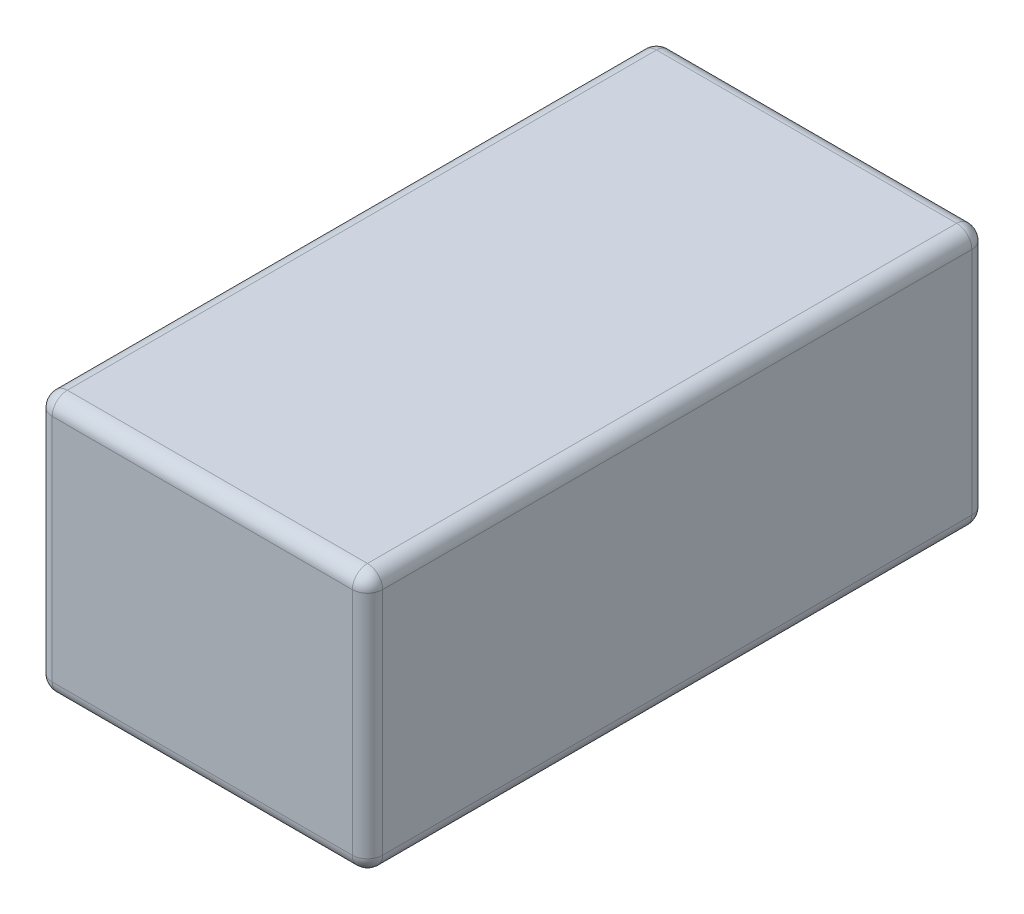
ISO-10303-21;
HEADER;
FILE_DESCRIPTION(('STEP AP214'),'2;1');
FILE_NAME('part.step','',(''),(''),'','','');
FILE_SCHEMA(('AUTOMOTIVE_DESIGN { 1 0 10303 214 1 1 1 1 }'));
ENDSEC;
DATA;
#1=APPLICATION_CONTEXT('core data for automotive mechanical design processes');
#2=APPLICATION_PROTOCOL_DEFINITION('international standard','automotive_design',2000,#1);
#3=PRODUCT_CONTEXT('',#1,'mechanical');
#4=PRODUCT('Part','Part','',(#3));
#5=PRODUCT_RELATED_PRODUCT_CATEGORY('part','',(#4));
#6=PRODUCT_DEFINITION_FORMATION('','',#4);
#7=PRODUCT_DEFINITION_CONTEXT('part definition',#1,'design');
#8=PRODUCT_DEFINITION('design','',#6,#7);
#9=PRODUCT_DEFINITION_SHAPE('','',#8);
#10=(LENGTH_UNIT() NAMED_UNIT(*) SI_UNIT(.MILLI.,.METRE.));
#11=(NAMED_UNIT(*) PLANE_ANGLE_UNIT() SI_UNIT($,.RADIAN.));
#12=(NAMED_UNIT(*) SI_UNIT($,.STERADIAN.) SOLID_ANGLE_UNIT());
#13=UNCERTAINTY_MEASURE_WITH_UNIT(LENGTH_MEASURE(1.E-05),#10,'distance_accuracy_value','');
#14=(GEOMETRIC_REPRESENTATION_CONTEXT(3) GLOBAL_UNCERTAINTY_ASSIGNED_CONTEXT((#13)) GLOBAL_UNIT_ASSIGNED_CONTEXT((#10,
#11,#12)) REPRESENTATION_CONTEXT('',''));
#15=CARTESIAN_POINT('',(0.,0.,0.));
#16=DIRECTION('',(0.,0.,1.));
#17=DIRECTION('',(1.,0.,0.));
#18=AXIS2_PLACEMENT_3D('',#15,#16,#17);
#19=CARTESIAN_POINT('',(41.5925,65.532,77.978));
#20=DIRECTION('',(-1.,0.,0.));
#21=DIRECTION('',(0.,0.,1.));
#22=AXIS2_PLACEMENT_3D('',#19,#20,#21);
#23=PLANE('',#22);
#24=DIRECTION('',(0.,-1.,0.));
#25=VECTOR('',#24,1.);
#26=CARTESIAN_POINT('',(41.5925,65.532,74.168));
#27=LINE('',#26,#25);
#28=CARTESIAN_POINT('',(41.5925,61.722,74.168));
#29=VERTEX_POINT('',#28);
#30=CARTESIAN_POINT('',(41.5925,3.81,74.168));
#31=VERTEX_POINT('',#30);
#32=EDGE_CURVE('E330',#29,#31,#27,.T.);
#33=ORIENTED_EDGE('',*,*,#32,.T.);
#34=DIRECTION('',(0.,0.,-1.));
#35=VECTOR('',#34,1.);
#36=CARTESIAN_POINT('',(41.5925,3.81,-77.978));
#37=LINE('',#36,#35);
#38=CARTESIAN_POINT('',(41.5925,3.81,-74.168));
#39=VERTEX_POINT('',#38);
#40=EDGE_CURVE('E335',#31,#39,#37,.T.);
#41=ORIENTED_EDGE('',*,*,#40,.T.);
#42=DIRECTION('',(0.,-1.,0.));
#43=VECTOR('',#42,1.);
#44=CARTESIAN_POINT('',(41.5925,65.532,-74.168));
#45=LINE('',#44,#43);
#46=CARTESIAN_POINT('',(41.5925,61.722,-74.168));
#47=VERTEX_POINT('',#46);
#48=EDGE_CURVE('E243',#39,#47,#45,.F.);
#49=ORIENTED_EDGE('',*,*,#48,.T.);
#50=DIRECTION('',(0.,0.,-1.));
#51=VECTOR('',#50,1.);
#52=CARTESIAN_POINT('',(41.5925,61.722,77.978));
#53=LINE('',#52,#51);
#54=EDGE_CURVE('E310',#47,#29,#53,.F.);
#55=ORIENTED_EDGE('',*,*,#54,.T.);
#56=EDGE_LOOP('',(#33,#41,#49,#55));
#57=FACE_BOUND('',#56,.T.);
#58=ADVANCED_FACE('F40',(#57),#23,.F.);
#59=CARTESIAN_POINT('',(-41.5925,65.532,-77.978));
#60=DIRECTION('',(0.,0.,1.));
#61=DIRECTION('',(1.,0.,0.));
#62=AXIS2_PLACEMENT_3D('',#59,#60,#61);
#63=PLANE('',#62);
#64=DIRECTION('',(-1.,0.,0.));
#65=VECTOR('',#64,1.);
#66=CARTESIAN_POINT('',(-41.5925,61.722,-77.978));
#67=LINE('',#66,#65);
#68=CARTESIAN_POINT('',(-37.7825,61.722,-77.978));
#69=VERTEX_POINT('',#68);
#70=CARTESIAN_POINT('',(37.7825,61.722,-77.978));
#71=VERTEX_POINT('',#70);
#72=EDGE_CURVE('E250',#69,#71,#67,.F.);
#73=ORIENTED_EDGE('',*,*,#72,.T.);
#74=DIRECTION('',(0.,-1.,0.));
#75=VECTOR('',#74,1.);
#76=CARTESIAN_POINT('',(37.7825,65.532,-77.978));
#77=LINE('',#76,#75);
#78=CARTESIAN_POINT('',(37.7825,3.81,-77.978));
#79=VERTEX_POINT('',#78);
#80=EDGE_CURVE('E246',#71,#79,#77,.T.);
#81=ORIENTED_EDGE('',*,*,#80,.T.);
#82=DIRECTION('',(-1.,0.,0.));
#83=VECTOR('',#82,1.);
#84=CARTESIAN_POINT('',(-41.5925,3.81,-77.978));
#85=LINE('',#84,#83);
#86=CARTESIAN_POINT('',(-37.7825,3.81,-77.978));
#87=VERTEX_POINT('',#86);
#88=EDGE_CURVE('E338',#79,#87,#85,.T.);
#89=ORIENTED_EDGE('',*,*,#88,.T.);
#90=DIRECTION('',(0.,-1.,0.));
#91=VECTOR('',#90,1.);
#92=CARTESIAN_POINT('',(-37.7825,65.532,-77.978));
#93=LINE('',#92,#91);
#94=EDGE_CURVE('E257',#87,#69,#93,.F.);
#95=ORIENTED_EDGE('',*,*,#94,.T.);
#96=EDGE_LOOP('',(#73,#81,#89,#95));
#97=FACE_BOUND('',#96,.T.);
#98=ADVANCED_FACE('F344',(#97),#63,.F.);
#99=CARTESIAN_POINT('',(-41.5925,65.532,77.978));
#100=DIRECTION('',(1.,0.,0.));
#101=DIRECTION('',(0.,0.,-1.));
#102=AXIS2_PLACEMENT_3D('',#99,#100,#101);
#103=PLANE('',#102);
#104=DIRECTION('',(0.,-1.,0.));
#105=VECTOR('',#104,1.);
#106=CARTESIAN_POINT('',(-41.5925,65.532,-74.168));
#107=LINE('',#106,#105);
#108=CARTESIAN_POINT('',(-41.5925,61.722,-74.168));
#109=VERTEX_POINT('',#108);
#110=CARTESIAN_POINT('',(-41.5925,3.81,-74.168));
#111=VERTEX_POINT('',#110);
#112=EDGE_CURVE('E141',#109,#111,#107,.T.);
#113=ORIENTED_EDGE('',*,*,#112,.T.);
#114=DIRECTION('',(0.,0.,1.));
#115=VECTOR('',#114,1.);
#116=CARTESIAN_POINT('',(-41.5925,3.81,77.978));
#117=LINE('',#116,#115);
#118=CARTESIAN_POINT('',(-41.5925,3.81,74.168));
#119=VERTEX_POINT('',#118);
#120=EDGE_CURVE('E136',#111,#119,#117,.T.);
#121=ORIENTED_EDGE('',*,*,#120,.T.);
#122=DIRECTION('',(0.,-1.,0.));
#123=VECTOR('',#122,1.);
#124=CARTESIAN_POINT('',(-41.5925,65.532,74.168));
#125=LINE('',#124,#123);
#126=CARTESIAN_POINT('',(-41.5925,61.722,74.168));
#127=VERTEX_POINT('',#126);
#128=EDGE_CURVE('E130',#119,#127,#125,.F.);
#129=ORIENTED_EDGE('',*,*,#128,.T.);
#130=DIRECTION('',(0.,0.,1.));
#131=VECTOR('',#130,1.);
#132=CARTESIAN_POINT('',(-41.5925,61.722,77.978));
#133=LINE('',#132,#131);
#134=EDGE_CURVE('E133',#127,#109,#133,.F.);
#135=ORIENTED_EDGE('',*,*,#134,.T.);
#136=EDGE_LOOP('',(#113,#121,#129,#135));
#137=FACE_BOUND('',#136,.T.);
#138=ADVANCED_FACE('F132',(#137),#103,.F.);
#139=CARTESIAN_POINT('',(-41.5925,65.532,77.978));
#140=DIRECTION('',(0.,0.,-1.));
#141=DIRECTION('',(-1.,0.,0.));
#142=AXIS2_PLACEMENT_3D('',#139,#140,#141);
#143=PLANE('',#142);
#144=DIRECTION('',(1.,0.,0.));
#145=VECTOR('',#144,1.);
#146=CARTESIAN_POINT('',(-41.5925,61.722,77.978));
#147=LINE('',#146,#145);
#148=CARTESIAN_POINT('',(37.7825,61.722,77.978));
#149=VERTEX_POINT('',#148);
#150=CARTESIAN_POINT('',(-37.7825,61.722,77.978));
#151=VERTEX_POINT('',#150);
#152=EDGE_CURVE('E50',#149,#151,#147,.F.);
#153=ORIENTED_EDGE('',*,*,#152,.T.);
#154=DIRECTION('',(0.,-1.,0.));
#155=VECTOR('',#154,1.);
#156=CARTESIAN_POINT('',(-37.7825,65.532,77.978));
#157=LINE('',#156,#155);
#158=CARTESIAN_POINT('',(-37.7825,3.81,77.978));
#159=VERTEX_POINT('',#158);
#160=EDGE_CURVE('E11',#151,#159,#157,.T.);
#161=ORIENTED_EDGE('',*,*,#160,.T.);
#162=DIRECTION('',(1.,0.,0.));
#163=VECTOR('',#162,1.);
#164=CARTESIAN_POINT('',(41.5925,3.81,77.978));
#165=LINE('',#164,#163);
#166=CARTESIAN_POINT('',(37.7825,3.81,77.978));
#167=VERTEX_POINT('',#166);
#168=EDGE_CURVE('E270',#159,#167,#165,.T.);
#169=ORIENTED_EDGE('',*,*,#168,.T.);
#170=DIRECTION('',(0.,-1.,0.));
#171=VECTOR('',#170,1.);
#172=CARTESIAN_POINT('',(37.7825,65.532,77.978));
#173=LINE('',#172,#171);
#174=EDGE_CURVE('E61',#167,#149,#173,.F.);
#175=ORIENTED_EDGE('',*,*,#174,.T.);
#176=EDGE_LOOP('',(#153,#161,#169,#175));
#177=FACE_BOUND('',#176,.T.);
#178=ADVANCED_FACE('F448',(#177),#143,.F.);
#179=CARTESIAN_POINT('',(0.,65.532,0.));
#180=DIRECTION('',(0.,-1.,0.));
#181=DIRECTION('',(0.,0.,-1.));
#182=AXIS2_PLACEMENT_3D('',#179,#180,#181);
#183=PLANE('',#182);
#184=DIRECTION('',(1.,0.,0.));
#185=VECTOR('',#184,1.);
#186=CARTESIAN_POINT('',(0.,65.532,74.168));
#187=LINE('',#186,#185);
#188=CARTESIAN_POINT('',(-37.7825,65.532,74.168));
#189=VERTEX_POINT('',#188);
#190=CARTESIAN_POINT('',(37.7825,65.532,74.168));
#191=VERTEX_POINT('',#190);
#192=EDGE_CURVE('E255',#189,#191,#187,.T.);
#193=ORIENTED_EDGE('',*,*,#192,.T.);
#194=DIRECTION('',(0.,0.,-1.));
#195=VECTOR('',#194,1.);
#196=CARTESIAN_POINT('',(37.7825,65.532,0.));
#197=LINE('',#196,#195);
#198=CARTESIAN_POINT('',(37.7825,65.532,-74.168));
#199=VERTEX_POINT('',#198);
#200=EDGE_CURVE('E267',#191,#199,#197,.T.);
#201=ORIENTED_EDGE('',*,*,#200,.T.);
#202=DIRECTION('',(-1.,0.,0.));
#203=VECTOR('',#202,1.);
#204=CARTESIAN_POINT('',(0.,65.532,-74.168));
#205=LINE('',#204,#203);
#206=CARTESIAN_POINT('',(-37.7825,65.532,-74.168));
#207=VERTEX_POINT('',#206);
#208=EDGE_CURVE('E263',#199,#207,#205,.T.);
#209=ORIENTED_EDGE('',*,*,#208,.T.);
#210=DIRECTION('',(0.,0.,1.));
#211=VECTOR('',#210,1.);
#212=CARTESIAN_POINT('',(-37.7825,65.532,0.));
#213=LINE('',#212,#211);
#214=EDGE_CURVE('E249',#207,#189,#213,.T.);
#215=ORIENTED_EDGE('',*,*,#214,.T.);
#216=EDGE_LOOP('',(#193,#201,#209,#215));
#217=FACE_BOUND('',#216,.T.);
#218=ADVANCED_FACE('F409',(#217),#183,.F.);
#219=CARTESIAN_POINT('',(0.,0.,0.));
#220=DIRECTION('',(0.,-1.,0.));
#221=DIRECTION('',(0.,0.,-1.));
#222=AXIS2_PLACEMENT_3D('',#219,#220,#221);
#223=PLANE('',#222);
#224=DIRECTION('',(0.,0.,1.));
#225=VECTOR('',#224,1.);
#226=CARTESIAN_POINT('',(-37.7825,0.,-77.978));
#227=LINE('',#226,#225);
#228=CARTESIAN_POINT('',(-37.7825,0.,74.168));
#229=VERTEX_POINT('',#228);
#230=CARTESIAN_POINT('',(-37.7825,0.,-74.168));
#231=VERTEX_POINT('',#230);
#232=EDGE_CURVE('E311',#229,#231,#227,.F.);
#233=ORIENTED_EDGE('',*,*,#232,.T.);
#234=DIRECTION('',(-1.,0.,0.));
#235=VECTOR('',#234,1.);
#236=CARTESIAN_POINT('',(41.5925,0.,-74.168));
#237=LINE('',#236,#235);
#238=CARTESIAN_POINT('',(37.7825,0.,-74.168));
#239=VERTEX_POINT('',#238);
#240=EDGE_CURVE('E303',#231,#239,#237,.F.);
#241=ORIENTED_EDGE('',*,*,#240,.T.);
#242=DIRECTION('',(0.,0.,-1.));
#243=VECTOR('',#242,1.);
#244=CARTESIAN_POINT('',(37.7825,0.,77.978));
#245=LINE('',#244,#243);
#246=CARTESIAN_POINT('',(37.7825,0.,74.168));
#247=VERTEX_POINT('',#246);
#248=EDGE_CURVE('E321',#239,#247,#245,.F.);
#249=ORIENTED_EDGE('',*,*,#248,.T.);
#250=DIRECTION('',(1.,0.,0.));
#251=VECTOR('',#250,1.);
#252=CARTESIAN_POINT('',(-41.5925,0.,74.168));
#253=LINE('',#252,#251);
#254=EDGE_CURVE('E316',#247,#229,#253,.F.);
#255=ORIENTED_EDGE('',*,*,#254,.T.);
#256=EDGE_LOOP('',(#233,#241,#249,#255));
#257=FACE_BOUND('',#256,.T.);
#258=ADVANCED_FACE('F314',(#257),#223,.T.);
#259=CARTESIAN_POINT('',(37.7825,61.722,0.));
#260=DIRECTION('',(0.,0.,-1.));
#261=DIRECTION('',(-1.,0.,0.));
#262=AXIS2_PLACEMENT_3D('',#259,#260,#261);
#263=CYLINDRICAL_SURFACE('',#262,3.81);
#264=CARTESIAN_POINT('',(37.7825,61.722,-74.168));
#265=DIRECTION('',(0.,0.,-1.));
#266=DIRECTION('',(-1.,0.,0.));
#267=AXIS2_PLACEMENT_3D('',#264,#265,#266);
#268=CIRCLE('',#267,3.81);
#269=EDGE_CURVE('E44',#199,#47,#268,.T.);
#270=ORIENTED_EDGE('',*,*,#269,.F.);
#271=ORIENTED_EDGE('',*,*,#200,.F.);
#272=CARTESIAN_POINT('',(37.7825,61.722,74.168));
#273=DIRECTION('',(0.,0.,1.));
#274=DIRECTION('',(1.,0.,0.));
#275=AXIS2_PLACEMENT_3D('',#272,#273,#274);
#276=CIRCLE('',#275,3.81);
#277=EDGE_CURVE('E218',#29,#191,#276,.T.);
#278=ORIENTED_EDGE('',*,*,#277,.F.);
#279=ORIENTED_EDGE('',*,*,#54,.F.);
#280=EDGE_LOOP('',(#270,#271,#278,#279));
#281=FACE_BOUND('',#280,.T.);
#282=ADVANCED_FACE('F42',(#281),#263,.T.);
#283=CARTESIAN_POINT('',(37.7825,61.722,-74.168));
#284=DIRECTION('',(1.,0.,0.));
#285=DIRECTION('',(0.,0.,-1.));
#286=AXIS2_PLACEMENT_3D('',#283,#284,#285);
#287=SPHERICAL_SURFACE('',#286,3.81);
#288=CARTESIAN_POINT('',(37.7825,61.722,-74.168));
#289=DIRECTION('',(1.,0.,0.));
#290=DIRECTION('',(0.,1.,0.));
#291=AXIS2_PLACEMENT_3D('',#288,#289,#290);
#292=CIRCLE('',#291,3.81);
#293=EDGE_CURVE('E211',#199,#71,#292,.F.);
#294=ORIENTED_EDGE('',*,*,#293,.F.);
#295=ORIENTED_EDGE('',*,*,#269,.T.);
#296=CARTESIAN_POINT('',(37.7825,61.722,-74.168));
#297=DIRECTION('',(0.,1.,0.));
#298=DIRECTION('',(0.,0.,1.));
#299=AXIS2_PLACEMENT_3D('',#296,#297,#298);
#300=CIRCLE('',#299,3.81);
#301=EDGE_CURVE('E215',#71,#47,#300,.F.);
#302=ORIENTED_EDGE('',*,*,#301,.F.);
#303=EDGE_LOOP('',(#294,#295,#302));
#304=FACE_BOUND('',#303,.T.);
#305=ADVANCED_FACE('F233',(#304),#287,.T.);
#306=CARTESIAN_POINT('',(37.7825,61.722,74.168));
#307=DIRECTION('',(0.,1.,0.));
#308=DIRECTION('',(0.,0.,1.));
#309=AXIS2_PLACEMENT_3D('',#306,#307,#308);
#310=SPHERICAL_SURFACE('',#309,3.81);
#311=CARTESIAN_POINT('',(37.7825,61.722,74.168));
#312=DIRECTION('',(0.,1.,0.));
#313=DIRECTION('',(0.,0.,1.));
#314=AXIS2_PLACEMENT_3D('',#311,#312,#313);
#315=CIRCLE('',#314,3.81);
#316=EDGE_CURVE('E204',#29,#149,#315,.F.);
#317=ORIENTED_EDGE('',*,*,#316,.F.);
#318=ORIENTED_EDGE('',*,*,#277,.T.);
#319=CARTESIAN_POINT('',(37.7825,61.722,74.168));
#320=DIRECTION('',(1.,0.,0.));
#321=DIRECTION('',(0.,0.,-1.));
#322=AXIS2_PLACEMENT_3D('',#319,#320,#321);
#323=CIRCLE('',#322,3.81);
#324=EDGE_CURVE('E207',#149,#191,#323,.F.);
#325=ORIENTED_EDGE('',*,*,#324,.F.);
#326=EDGE_LOOP('',(#317,#318,#325));
#327=FACE_BOUND('',#326,.T.);
#328=ADVANCED_FACE('F404',(#327),#310,.T.);
#329=CARTESIAN_POINT('',(37.7825,65.532,-74.168));
#330=DIRECTION('',(0.,-1.,0.));
#331=DIRECTION('',(0.,0.,-1.));
#332=AXIS2_PLACEMENT_3D('',#329,#330,#331);
#333=CYLINDRICAL_SURFACE('',#332,3.81);
#334=ORIENTED_EDGE('',*,*,#301,.T.);
#335=ORIENTED_EDGE('',*,*,#48,.F.);
#336=CARTESIAN_POINT('',(37.7825,3.81,-74.168));
#337=DIRECTION('',(0.,-1.,0.));
#338=DIRECTION('',(0.,0.,-1.));
#339=AXIS2_PLACEMENT_3D('',#336,#337,#338);
#340=CIRCLE('',#339,3.81);
#341=EDGE_CURVE('E197',#79,#39,#340,.T.);
#342=ORIENTED_EDGE('',*,*,#341,.F.);
#343=ORIENTED_EDGE('',*,*,#80,.F.);
#344=EDGE_LOOP('',(#334,#335,#342,#343));
#345=FACE_BOUND('',#344,.T.);
#346=ADVANCED_FACE('F241',(#345),#333,.T.);
#347=CARTESIAN_POINT('',(0.,61.722,-74.168));
#348=DIRECTION('',(-1.,0.,0.));
#349=DIRECTION('',(0.,0.,1.));
#350=AXIS2_PLACEMENT_3D('',#347,#348,#349);
#351=CYLINDRICAL_SURFACE('',#350,3.81);
#352=ORIENTED_EDGE('',*,*,#293,.T.);
#353=ORIENTED_EDGE('',*,*,#72,.F.);
#354=CARTESIAN_POINT('',(-37.7825,61.722,-74.168));
#355=DIRECTION('',(-1.,0.,0.));
#356=DIRECTION('',(0.,0.,1.));
#357=AXIS2_PLACEMENT_3D('',#354,#355,#356);
#358=CIRCLE('',#357,3.81);
#359=EDGE_CURVE('E193',#207,#69,#358,.T.);
#360=ORIENTED_EDGE('',*,*,#359,.F.);
#361=ORIENTED_EDGE('',*,*,#208,.F.);
#362=EDGE_LOOP('',(#352,#353,#360,#361));
#363=FACE_BOUND('',#362,.T.);
#364=ADVANCED_FACE('F348',(#363),#351,.T.);
#365=CARTESIAN_POINT('',(-37.7825,61.722,0.));
#366=DIRECTION('',(0.,0.,1.));
#367=DIRECTION('',(1.,0.,0.));
#368=AXIS2_PLACEMENT_3D('',#365,#366,#367);
#369=CYLINDRICAL_SURFACE('',#368,3.81);
#370=CARTESIAN_POINT('',(-37.7825,61.722,74.168));
#371=DIRECTION('',(0.,0.,1.));
#372=DIRECTION('',(1.,0.,0.));
#373=AXIS2_PLACEMENT_3D('',#370,#371,#372);
#374=CIRCLE('',#373,3.81);
#375=EDGE_CURVE('E148',#189,#127,#374,.T.);
#376=ORIENTED_EDGE('',*,*,#375,.F.);
#377=ORIENTED_EDGE('',*,*,#214,.F.);
#378=CARTESIAN_POINT('',(-37.7825,61.722,-74.168));
#379=DIRECTION('',(0.,0.,-1.));
#380=DIRECTION('',(0.,1.,0.));
#381=AXIS2_PLACEMENT_3D('',#378,#379,#380);
#382=CIRCLE('',#381,3.81);
#383=EDGE_CURVE('E150',#109,#207,#382,.T.);
#384=ORIENTED_EDGE('',*,*,#383,.F.);
#385=ORIENTED_EDGE('',*,*,#134,.F.);
#386=EDGE_LOOP('',(#376,#377,#384,#385));
#387=FACE_BOUND('',#386,.T.);
#388=ADVANCED_FACE('F146',(#387),#369,.T.);
#389=CARTESIAN_POINT('',(0.,61.722,74.168));
#390=DIRECTION('',(1.,0.,0.));
#391=DIRECTION('',(0.,0.,-1.));
#392=AXIS2_PLACEMENT_3D('',#389,#390,#391);
#393=CYLINDRICAL_SURFACE('',#392,3.81);
#394=ORIENTED_EDGE('',*,*,#324,.T.);
#395=ORIENTED_EDGE('',*,*,#192,.F.);
#396=CARTESIAN_POINT('',(-37.7825,61.722,74.168));
#397=DIRECTION('',(-1.,0.,0.));
#398=DIRECTION('',(0.,0.,1.));
#399=AXIS2_PLACEMENT_3D('',#396,#397,#398);
#400=CIRCLE('',#399,3.81);
#401=EDGE_CURVE('E159',#151,#189,#400,.T.);
#402=ORIENTED_EDGE('',*,*,#401,.F.);
#403=ORIENTED_EDGE('',*,*,#152,.F.);
#404=EDGE_LOOP('',(#394,#395,#402,#403));
#405=FACE_BOUND('',#404,.T.);
#406=ADVANCED_FACE('F407',(#405),#393,.T.);
#407=CARTESIAN_POINT('',(37.7825,65.532,74.168));
#408=DIRECTION('',(0.,-1.,0.));
#409=DIRECTION('',(0.,0.,-1.));
#410=AXIS2_PLACEMENT_3D('',#407,#408,#409);
#411=CYLINDRICAL_SURFACE('',#410,3.81);
#412=ORIENTED_EDGE('',*,*,#316,.T.);
#413=ORIENTED_EDGE('',*,*,#174,.F.);
#414=CARTESIAN_POINT('',(37.7825,3.81,74.168));
#415=DIRECTION('',(0.,-1.,0.));
#416=DIRECTION('',(0.,0.,-1.));
#417=AXIS2_PLACEMENT_3D('',#414,#415,#416);
#418=CIRCLE('',#417,3.81);
#419=EDGE_CURVE('E185',#31,#167,#418,.T.);
#420=ORIENTED_EDGE('',*,*,#419,.F.);
#421=ORIENTED_EDGE('',*,*,#32,.F.);
#422=EDGE_LOOP('',(#412,#413,#420,#421));
#423=FACE_BOUND('',#422,.T.);
#424=ADVANCED_FACE('F403',(#423),#411,.T.);
#425=CARTESIAN_POINT('',(37.7825,3.81,77.978));
#426=DIRECTION('',(0.,0.,1.));
#427=DIRECTION('',(1.,0.,0.));
#428=AXIS2_PLACEMENT_3D('',#425,#426,#427);
#429=CYLINDRICAL_SURFACE('',#428,3.81);
#430=CARTESIAN_POINT('',(37.7825,3.81,-74.168));
#431=DIRECTION('',(0.,0.,-1.));
#432=DIRECTION('',(-1.,0.,0.));
#433=AXIS2_PLACEMENT_3D('',#430,#431,#432);
#434=CIRCLE('',#433,3.81);
#435=EDGE_CURVE('E200',#39,#239,#434,.T.);
#436=ORIENTED_EDGE('',*,*,#435,.F.);
#437=ORIENTED_EDGE('',*,*,#40,.F.);
#438=CARTESIAN_POINT('',(37.7825,3.81,74.168));
#439=DIRECTION('',(0.,0.,1.));
#440=DIRECTION('',(1.,0.,0.));
#441=AXIS2_PLACEMENT_3D('',#438,#439,#440);
#442=CIRCLE('',#441,3.81);
#443=EDGE_CURVE('E181',#247,#31,#442,.T.);
#444=ORIENTED_EDGE('',*,*,#443,.F.);
#445=ORIENTED_EDGE('',*,*,#248,.F.);
#446=EDGE_LOOP('',(#436,#437,#444,#445));
#447=FACE_BOUND('',#446,.T.);
#448=ADVANCED_FACE('F413',(#447),#429,.T.);
#449=CARTESIAN_POINT('',(37.7825,3.81,-74.168));
#450=DIRECTION('',(1.,0.,0.));
#451=DIRECTION('',(0.,1.,0.));
#452=AXIS2_PLACEMENT_3D('',#449,#450,#451);
#453=SPHERICAL_SURFACE('',#452,3.81);
#454=ORIENTED_EDGE('',*,*,#341,.T.);
#455=ORIENTED_EDGE('',*,*,#435,.T.);
#456=CARTESIAN_POINT('',(37.7825,3.81,-74.168));
#457=DIRECTION('',(1.,0.,0.));
#458=DIRECTION('',(0.,0.,-1.));
#459=AXIS2_PLACEMENT_3D('',#456,#457,#458);
#460=CIRCLE('',#459,3.81);
#461=EDGE_CURVE('E171',#79,#239,#460,.F.);
#462=ORIENTED_EDGE('',*,*,#461,.F.);
#463=EDGE_LOOP('',(#454,#455,#462));
#464=FACE_BOUND('',#463,.T.);
#465=ADVANCED_FACE('F415',(#464),#453,.T.);
#466=CARTESIAN_POINT('',(-37.7825,61.722,-74.168));
#467=DIRECTION('',(0.,1.,0.));
#468=DIRECTION('',(0.,0.,1.));
#469=AXIS2_PLACEMENT_3D('',#466,#467,#468);
#470=SPHERICAL_SURFACE('',#469,3.81);
#471=ORIENTED_EDGE('',*,*,#383,.T.);
#472=ORIENTED_EDGE('',*,*,#359,.T.);
#473=CARTESIAN_POINT('',(-37.7825,61.722,-74.168));
#474=DIRECTION('',(0.,1.,0.));
#475=DIRECTION('',(0.,0.,1.));
#476=AXIS2_PLACEMENT_3D('',#473,#474,#475);
#477=CIRCLE('',#476,3.81);
#478=EDGE_CURVE('E164',#109,#69,#477,.F.);
#479=ORIENTED_EDGE('',*,*,#478,.F.);
#480=EDGE_LOOP('',(#471,#472,#479));
#481=FACE_BOUND('',#480,.T.);
#482=ADVANCED_FACE('F350',(#481),#470,.T.);
#483=CARTESIAN_POINT('',(-37.7825,61.722,74.168));
#484=DIRECTION('',(0.,1.,0.));
#485=DIRECTION('',(0.,0.,1.));
#486=AXIS2_PLACEMENT_3D('',#483,#484,#485);
#487=SPHERICAL_SURFACE('',#486,3.81);
#488=ORIENTED_EDGE('',*,*,#401,.T.);
#489=ORIENTED_EDGE('',*,*,#375,.T.);
#490=CARTESIAN_POINT('',(-37.7825,61.722,74.168));
#491=DIRECTION('',(0.,1.,0.));
#492=DIRECTION('',(0.,0.,1.));
#493=AXIS2_PLACEMENT_3D('',#490,#491,#492);
#494=CIRCLE('',#493,3.81);
#495=EDGE_CURVE('E157',#151,#127,#494,.F.);
#496=ORIENTED_EDGE('',*,*,#495,.F.);
#497=EDGE_LOOP('',(#488,#489,#496));
#498=FACE_BOUND('',#497,.T.);
#499=ADVANCED_FACE('F156',(#498),#487,.T.);
#500=CARTESIAN_POINT('',(37.7825,3.81,74.168));
#501=DIRECTION('',(1.,0.,0.));
#502=DIRECTION('',(0.,1.,0.));
#503=AXIS2_PLACEMENT_3D('',#500,#501,#502);
#504=SPHERICAL_SURFACE('',#503,3.81);
#505=ORIENTED_EDGE('',*,*,#443,.T.);
#506=ORIENTED_EDGE('',*,*,#419,.T.);
#507=CARTESIAN_POINT('',(37.7825,3.81,74.168));
#508=DIRECTION('',(1.,0.,0.));
#509=DIRECTION('',(0.,0.,-1.));
#510=AXIS2_PLACEMENT_3D('',#507,#508,#509);
#511=CIRCLE('',#510,3.81);
#512=EDGE_CURVE('E165',#247,#167,#511,.F.);
#513=ORIENTED_EDGE('',*,*,#512,.F.);
#514=EDGE_LOOP('',(#505,#506,#513));
#515=FACE_BOUND('',#514,.T.);
#516=ADVANCED_FACE('F372',(#515),#504,.T.);
#517=CARTESIAN_POINT('',(-41.5925,3.81,-74.168));
#518=DIRECTION('',(1.,0.,0.));
#519=DIRECTION('',(0.,0.,-1.));
#520=AXIS2_PLACEMENT_3D('',#517,#518,#519);
#521=CYLINDRICAL_SURFACE('',#520,3.81);
#522=ORIENTED_EDGE('',*,*,#461,.T.);
#523=ORIENTED_EDGE('',*,*,#240,.F.);
#524=CARTESIAN_POINT('',(-37.7825,3.81,-74.168));
#525=DIRECTION('',(-1.,0.,0.));
#526=DIRECTION('',(0.,0.,1.));
#527=AXIS2_PLACEMENT_3D('',#524,#525,#526);
#528=CIRCLE('',#527,3.81);
#529=EDGE_CURVE('E174',#87,#231,#528,.T.);
#530=ORIENTED_EDGE('',*,*,#529,.F.);
#531=ORIENTED_EDGE('',*,*,#88,.F.);
#532=EDGE_LOOP('',(#522,#523,#530,#531));
#533=FACE_BOUND('',#532,.T.);
#534=ADVANCED_FACE('F305',(#533),#521,.T.);
#535=CARTESIAN_POINT('',(-37.7825,65.532,-74.168));
#536=DIRECTION('',(0.,-1.,0.));
#537=DIRECTION('',(0.,0.,-1.));
#538=AXIS2_PLACEMENT_3D('',#535,#536,#537);
#539=CYLINDRICAL_SURFACE('',#538,3.81);
#540=ORIENTED_EDGE('',*,*,#478,.T.);
#541=ORIENTED_EDGE('',*,*,#94,.F.);
#542=CARTESIAN_POINT('',(-37.7825,3.81,-74.168));
#543=DIRECTION('',(0.,-1.,0.));
#544=DIRECTION('',(0.,0.,-1.));
#545=AXIS2_PLACEMENT_3D('',#542,#543,#544);
#546=CIRCLE('',#545,3.81);
#547=EDGE_CURVE('E290',#111,#87,#546,.T.);
#548=ORIENTED_EDGE('',*,*,#547,.F.);
#549=ORIENTED_EDGE('',*,*,#112,.F.);
#550=EDGE_LOOP('',(#540,#541,#548,#549));
#551=FACE_BOUND('',#550,.T.);
#552=ADVANCED_FACE('F352',(#551),#539,.T.);
#553=CARTESIAN_POINT('',(-37.7825,65.532,74.168));
#554=DIRECTION('',(0.,-1.,0.));
#555=DIRECTION('',(0.,0.,-1.));
#556=AXIS2_PLACEMENT_3D('',#553,#554,#555);
#557=CYLINDRICAL_SURFACE('',#556,3.81);
#558=ORIENTED_EDGE('',*,*,#495,.T.);
#559=ORIENTED_EDGE('',*,*,#128,.F.);
#560=CARTESIAN_POINT('',(-37.7825,3.81,74.168));
#561=DIRECTION('',(0.,-1.,0.));
#562=DIRECTION('',(0.,0.,-1.));
#563=AXIS2_PLACEMENT_3D('',#560,#561,#562);
#564=CIRCLE('',#563,3.81);
#565=EDGE_CURVE('E286',#159,#119,#564,.T.);
#566=ORIENTED_EDGE('',*,*,#565,.F.);
#567=ORIENTED_EDGE('',*,*,#160,.F.);
#568=EDGE_LOOP('',(#558,#559,#566,#567));
#569=FACE_BOUND('',#568,.T.);
#570=ADVANCED_FACE('F162',(#569),#557,.T.);
#571=CARTESIAN_POINT('',(-41.5925,3.81,74.168));
#572=DIRECTION('',(-1.,0.,0.));
#573=DIRECTION('',(0.,0.,1.));
#574=AXIS2_PLACEMENT_3D('',#571,#572,#573);
#575=CYLINDRICAL_SURFACE('',#574,3.81);
#576=ORIENTED_EDGE('',*,*,#512,.T.);
#577=ORIENTED_EDGE('',*,*,#168,.F.);
#578=CARTESIAN_POINT('',(-37.7825,3.81,74.168));
#579=DIRECTION('',(-1.,0.,0.));
#580=DIRECTION('',(0.,0.,1.));
#581=AXIS2_PLACEMENT_3D('',#578,#579,#580);
#582=CIRCLE('',#581,3.81);
#583=EDGE_CURVE('E283',#229,#159,#582,.T.);
#584=ORIENTED_EDGE('',*,*,#583,.F.);
#585=ORIENTED_EDGE('',*,*,#254,.F.);
#586=EDGE_LOOP('',(#576,#577,#584,#585));
#587=FACE_BOUND('',#586,.T.);
#588=ADVANCED_FACE('F370',(#587),#575,.T.);
#589=CARTESIAN_POINT('',(-37.7825,3.81,-74.168));
#590=DIRECTION('',(0.,0.,-1.));
#591=DIRECTION('',(0.,1.,0.));
#592=AXIS2_PLACEMENT_3D('',#589,#590,#591);
#593=SPHERICAL_SURFACE('',#592,3.81);
#594=ORIENTED_EDGE('',*,*,#547,.T.);
#595=ORIENTED_EDGE('',*,*,#529,.T.);
#596=CARTESIAN_POINT('',(-37.7825,3.81,-74.168));
#597=DIRECTION('',(0.,0.,-1.));
#598=DIRECTION('',(-1.,0.,0.));
#599=AXIS2_PLACEMENT_3D('',#596,#597,#598);
#600=CIRCLE('',#599,3.81);
#601=EDGE_CURVE('E280',#111,#231,#600,.F.);
#602=ORIENTED_EDGE('',*,*,#601,.F.);
#603=EDGE_LOOP('',(#594,#595,#602));
#604=FACE_BOUND('',#603,.T.);
#605=ADVANCED_FACE('F300',(#604),#593,.T.);
#606=CARTESIAN_POINT('',(-37.7825,3.81,74.168));
#607=DIRECTION('',(0.,0.,1.));
#608=DIRECTION('',(0.,-1.,0.));
#609=AXIS2_PLACEMENT_3D('',#606,#607,#608);
#610=SPHERICAL_SURFACE('',#609,3.81);
#611=ORIENTED_EDGE('',*,*,#583,.T.);
#612=ORIENTED_EDGE('',*,*,#565,.T.);
#613=CARTESIAN_POINT('',(-37.7825,3.81,74.168));
#614=DIRECTION('',(0.,0.,1.));
#615=DIRECTION('',(1.,0.,0.));
#616=AXIS2_PLACEMENT_3D('',#613,#614,#615);
#617=CIRCLE('',#616,3.81);
#618=EDGE_CURVE('E277',#229,#119,#617,.F.);
#619=ORIENTED_EDGE('',*,*,#618,.F.);
#620=EDGE_LOOP('',(#611,#612,#619));
#621=FACE_BOUND('',#620,.T.);
#622=ADVANCED_FACE('F386',(#621),#610,.T.);
#623=CARTESIAN_POINT('',(-37.7825,3.81,77.978));
#624=DIRECTION('',(0.,0.,-1.));
#625=DIRECTION('',(-1.,0.,0.));
#626=AXIS2_PLACEMENT_3D('',#623,#624,#625);
#627=CYLINDRICAL_SURFACE('',#626,3.81);
#628=ORIENTED_EDGE('',*,*,#601,.T.);
#629=ORIENTED_EDGE('',*,*,#232,.F.);
#630=ORIENTED_EDGE('',*,*,#618,.T.);
#631=ORIENTED_EDGE('',*,*,#120,.F.);
#632=EDGE_LOOP('',(#628,#629,#630,#631));
#633=FACE_BOUND('',#632,.T.);
#634=ADVANCED_FACE('F383',(#633),#627,.T.);
#635=CLOSED_SHELL('',(#58,#98,#138,#178,#218,#258,#282,#305,#328,#346,#364,#388,#406,#424,#448,
#465,#482,#499,#516,#534,#552,#570,#588,#605,#622,#634));
#636=MANIFOLD_SOLID_BREP('B2',#635);
#637=ADVANCED_BREP_SHAPE_REPRESENTATION('',(#18,#636),#14);
#638=SHAPE_DEFINITION_REPRESENTATION(#9,#637);
ENDSEC;
END-ISO-10303-21;
